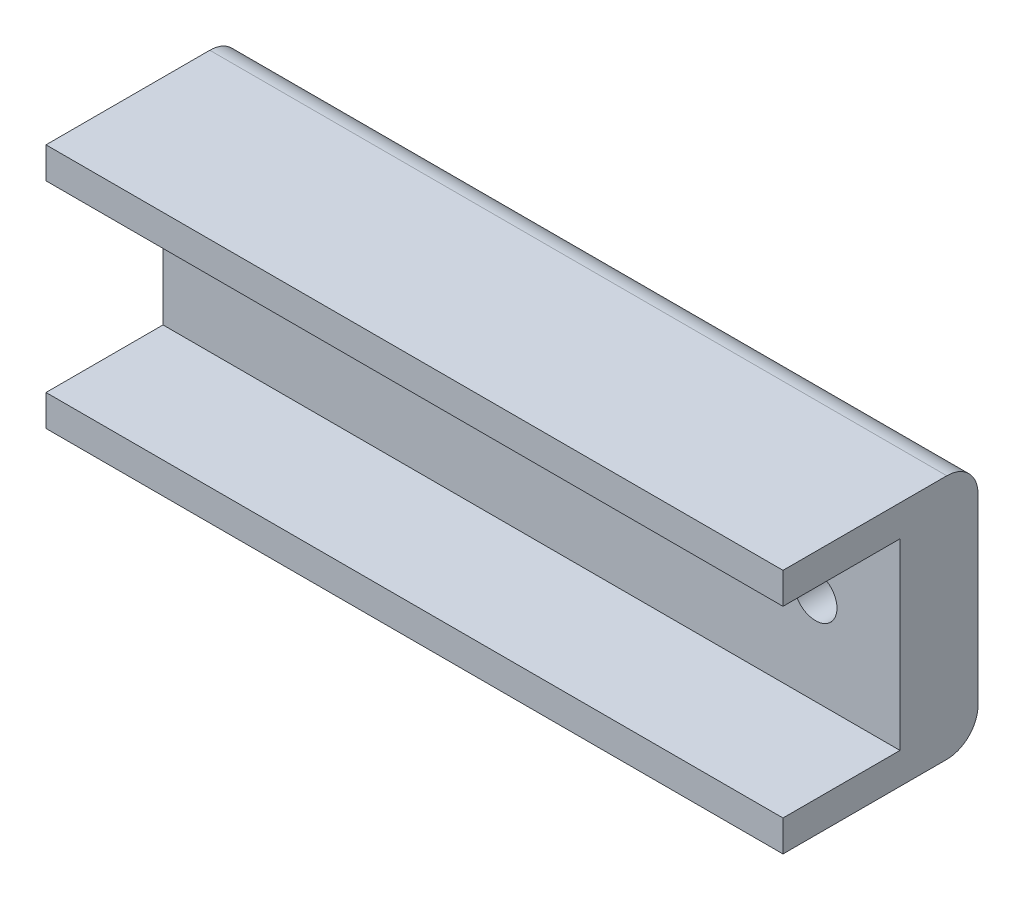
ISO-10303-21;
HEADER;
FILE_DESCRIPTION(('STEP AP214'),'2;1');
FILE_NAME('part.step','',(''),(''),'','','');
FILE_SCHEMA(('AUTOMOTIVE_DESIGN { 1 0 10303 214 1 1 1 1 }'));
ENDSEC;
DATA;
#1=APPLICATION_CONTEXT('core data for automotive mechanical design processes');
#2=APPLICATION_PROTOCOL_DEFINITION('international standard','automotive_design',2000,#1);
#3=PRODUCT_CONTEXT('',#1,'mechanical');
#4=PRODUCT('Part','Part','',(#3));
#5=PRODUCT_RELATED_PRODUCT_CATEGORY('part','',(#4));
#6=PRODUCT_DEFINITION_FORMATION('','',#4);
#7=PRODUCT_DEFINITION_CONTEXT('part definition',#1,'design');
#8=PRODUCT_DEFINITION('design','',#6,#7);
#9=PRODUCT_DEFINITION_SHAPE('','',#8);
#10=(LENGTH_UNIT() NAMED_UNIT(*) SI_UNIT(.MILLI.,.METRE.));
#11=(NAMED_UNIT(*) PLANE_ANGLE_UNIT() SI_UNIT($,.RADIAN.));
#12=(NAMED_UNIT(*) SI_UNIT($,.STERADIAN.) SOLID_ANGLE_UNIT());
#13=UNCERTAINTY_MEASURE_WITH_UNIT(LENGTH_MEASURE(1.E-05),#10,'distance_accuracy_value','');
#14=(GEOMETRIC_REPRESENTATION_CONTEXT(3) GLOBAL_UNCERTAINTY_ASSIGNED_CONTEXT((#13)) GLOBAL_UNIT_ASSIGNED_CONTEXT((#10,
#11,#12)) REPRESENTATION_CONTEXT('',''));
#15=CARTESIAN_POINT('',(0.,0.,0.));
#16=DIRECTION('',(0.,0.,1.));
#17=DIRECTION('',(1.,0.,0.));
#18=AXIS2_PLACEMENT_3D('',#15,#16,#17);
#19=CARTESIAN_POINT('',(0.,0.,6.35));
#20=DIRECTION('',(0.,0.,1.));
#21=DIRECTION('',(1.,0.,0.));
#22=AXIS2_PLACEMENT_3D('',#19,#20,#21);
#23=PLANE('',#22);
#24=CARTESIAN_POINT('',(-23.12,0.,6.35));
#25=DIRECTION('',(0.,0.,1.));
#26=DIRECTION('',(1.,0.,0.));
#27=AXIS2_PLACEMENT_3D('',#24,#25,#26);
#28=CIRCLE('',#27,1.75);
#29=CARTESIAN_POINT('',(-21.37,0.,6.35));
#30=VERTEX_POINT('',#29);
#31=EDGE_CURVE('E200',#30,#30,#28,.T.);
#32=ORIENTED_EDGE('',*,*,#31,.F.);
#33=EDGE_LOOP('',(#32));
#34=FACE_BOUND('',#33,.T.);
#35=CARTESIAN_POINT('',(23.12,0.,6.35));
#36=DIRECTION('',(0.,0.,1.));
#37=DIRECTION('',(1.,0.,0.));
#38=AXIS2_PLACEMENT_3D('',#35,#36,#37);
#39=CIRCLE('',#38,1.75);
#40=CARTESIAN_POINT('',(24.87,0.,6.35));
#41=VERTEX_POINT('',#40);
#42=EDGE_CURVE('E192',#41,#41,#39,.T.);
#43=ORIENTED_EDGE('',*,*,#42,.F.);
#44=EDGE_LOOP('',(#43));
#45=FACE_BOUND('',#44,.T.);
#46=DIRECTION('',(0.,-1.,0.));
#47=VECTOR('',#46,1.);
#48=CARTESIAN_POINT('',(-30.,-10.,6.35));
#49=LINE('',#48,#47);
#50=CARTESIAN_POINT('',(-30.,7.46,6.35));
#51=VERTEX_POINT('',#50);
#52=CARTESIAN_POINT('',(-30.,-7.46,6.35));
#53=VERTEX_POINT('',#52);
#54=EDGE_CURVE('E208',#51,#53,#49,.T.);
#55=ORIENTED_EDGE('',*,*,#54,.T.);
#56=DIRECTION('',(-1.,0.,0.));
#57=VECTOR('',#56,1.);
#58=CARTESIAN_POINT('',(-30.,-7.46,6.35));
#59=LINE('',#58,#57);
#60=CARTESIAN_POINT('',(30.,-7.46,6.35));
#61=VERTEX_POINT('',#60);
#62=EDGE_CURVE('E147',#61,#53,#59,.T.);
#63=ORIENTED_EDGE('',*,*,#62,.F.);
#64=DIRECTION('',(0.,1.,0.));
#65=VECTOR('',#64,1.);
#66=CARTESIAN_POINT('',(30.,-9.99999999999999,6.35));
#67=LINE('',#66,#65);
#68=CARTESIAN_POINT('',(30.,7.46,6.35));
#69=VERTEX_POINT('',#68);
#70=EDGE_CURVE('E211',#61,#69,#67,.T.);
#71=ORIENTED_EDGE('',*,*,#70,.T.);
#72=DIRECTION('',(1.,0.,0.));
#73=VECTOR('',#72,1.);
#74=CARTESIAN_POINT('',(-30.,7.46,6.35));
#75=LINE('',#74,#73);
#76=EDGE_CURVE('E164',#51,#69,#75,.T.);
#77=ORIENTED_EDGE('',*,*,#76,.F.);
#78=EDGE_LOOP('',(#55,#63,#71,#77));
#79=FACE_BOUND('',#78,.T.);
#80=ADVANCED_FACE('F38',(#34,#45,#79),#23,.T.);
#81=CARTESIAN_POINT('',(0.,0.,0.));
#82=DIRECTION('',(0.,0.,1.));
#83=DIRECTION('',(1.,0.,0.));
#84=AXIS2_PLACEMENT_3D('',#81,#82,#83);
#85=PLANE('',#84);
#86=DIRECTION('',(0.,-1.,0.));
#87=VECTOR('',#86,1.);
#88=CARTESIAN_POINT('',(-30.,-10.,0.));
#89=LINE('',#88,#87);
#90=CARTESIAN_POINT('',(-30.,7.46,0.));
#91=VERTEX_POINT('',#90);
#92=CARTESIAN_POINT('',(-30.,-7.46,0.));
#93=VERTEX_POINT('',#92);
#94=EDGE_CURVE('E204',#91,#93,#89,.T.);
#95=ORIENTED_EDGE('',*,*,#94,.F.);
#96=DIRECTION('',(-1.,0.,0.));
#97=VECTOR('',#96,1.);
#98=CARTESIAN_POINT('',(0.,7.46,0.));
#99=LINE('',#98,#97);
#100=CARTESIAN_POINT('',(30.,7.45999999999999,0.));
#101=VERTEX_POINT('',#100);
#102=EDGE_CURVE('E61',#91,#101,#99,.F.);
#103=ORIENTED_EDGE('',*,*,#102,.T.);
#104=DIRECTION('',(0.,1.,0.));
#105=VECTOR('',#104,1.);
#106=CARTESIAN_POINT('',(30.,-9.99999999999999,0.));
#107=LINE('',#106,#105);
#108=CARTESIAN_POINT('',(30.,-7.45999999999999,0.));
#109=VERTEX_POINT('',#108);
#110=EDGE_CURVE('E212',#109,#101,#107,.T.);
#111=ORIENTED_EDGE('',*,*,#110,.F.);
#112=DIRECTION('',(1.,0.,0.));
#113=VECTOR('',#112,1.);
#114=CARTESIAN_POINT('',(0.,-7.46,0.));
#115=LINE('',#114,#113);
#116=EDGE_CURVE('E236',#109,#93,#115,.F.);
#117=ORIENTED_EDGE('',*,*,#116,.T.);
#118=EDGE_LOOP('',(#95,#103,#111,#117));
#119=FACE_BOUND('',#118,.T.);
#120=CARTESIAN_POINT('',(-23.12,0.,0.));
#121=DIRECTION('',(0.,0.,1.));
#122=DIRECTION('',(1.,0.,0.));
#123=AXIS2_PLACEMENT_3D('',#120,#121,#122);
#124=CIRCLE('',#123,1.75);
#125=CARTESIAN_POINT('',(-21.37,0.,0.));
#126=VERTEX_POINT('',#125);
#127=EDGE_CURVE('E196',#126,#126,#124,.T.);
#128=ORIENTED_EDGE('',*,*,#127,.T.);
#129=EDGE_LOOP('',(#128));
#130=FACE_BOUND('',#129,.T.);
#131=CARTESIAN_POINT('',(23.12,0.,0.));
#132=DIRECTION('',(0.,0.,1.));
#133=DIRECTION('',(1.,0.,0.));
#134=AXIS2_PLACEMENT_3D('',#131,#132,#133);
#135=CIRCLE('',#134,1.75);
#136=CARTESIAN_POINT('',(24.87,0.,0.));
#137=VERTEX_POINT('',#136);
#138=EDGE_CURVE('E191',#137,#137,#135,.T.);
#139=ORIENTED_EDGE('',*,*,#138,.T.);
#140=EDGE_LOOP('',(#139));
#141=FACE_BOUND('',#140,.T.);
#142=ADVANCED_FACE('F254',(#119,#130,#141),#85,.F.);
#143=CARTESIAN_POINT('',(-30.,-10.,6.35));
#144=DIRECTION('',(1.,0.,0.));
#145=DIRECTION('',(0.,0.,-1.));
#146=AXIS2_PLACEMENT_3D('',#143,#144,#145);
#147=PLANE('',#146);
#148=DIRECTION('',(0.,0.,-1.));
#149=VECTOR('',#148,1.);
#150=CARTESIAN_POINT('',(-30.,10.,6.35));
#151=LINE('',#150,#149);
#152=CARTESIAN_POINT('',(-30.,10.,15.875));
#153=VERTEX_POINT('',#152);
#154=CARTESIAN_POINT('',(-30.,10.,2.54));
#155=VERTEX_POINT('',#154);
#156=EDGE_CURVE('E215',#153,#155,#151,.T.);
#157=ORIENTED_EDGE('',*,*,#156,.T.);
#158=CARTESIAN_POINT('',(-30.,7.46,2.54));
#159=DIRECTION('',(1.,0.,0.));
#160=DIRECTION('',(0.,0.,-1.));
#161=AXIS2_PLACEMENT_3D('',#158,#159,#160);
#162=CIRCLE('',#161,2.54);
#163=EDGE_CURVE('E233',#155,#91,#162,.F.);
#164=ORIENTED_EDGE('',*,*,#163,.T.);
#165=ORIENTED_EDGE('',*,*,#94,.T.);
#166=CARTESIAN_POINT('',(-30.,-7.46,2.54));
#167=DIRECTION('',(1.,0.,0.));
#168=DIRECTION('',(0.,0.,-1.));
#169=AXIS2_PLACEMENT_3D('',#166,#167,#168);
#170=CIRCLE('',#169,2.54);
#171=CARTESIAN_POINT('',(-30.,-10.,2.54));
#172=VERTEX_POINT('',#171);
#173=EDGE_CURVE('E127',#93,#172,#170,.F.);
#174=ORIENTED_EDGE('',*,*,#173,.T.);
#175=DIRECTION('',(0.,0.,-1.));
#176=VECTOR('',#175,1.);
#177=CARTESIAN_POINT('',(-30.,-10.,6.35));
#178=LINE('',#177,#176);
#179=CARTESIAN_POINT('',(-30.,-10.,15.875));
#180=VERTEX_POINT('',#179);
#181=EDGE_CURVE('E118',#180,#172,#178,.T.);
#182=ORIENTED_EDGE('',*,*,#181,.F.);
#183=DIRECTION('',(0.,-1.,0.));
#184=VECTOR('',#183,1.);
#185=CARTESIAN_POINT('',(-30.,-10.,15.875));
#186=LINE('',#185,#184);
#187=CARTESIAN_POINT('',(-30.,-7.46,15.875));
#188=VERTEX_POINT('',#187);
#189=EDGE_CURVE('E124',#188,#180,#186,.T.);
#190=ORIENTED_EDGE('',*,*,#189,.F.);
#191=DIRECTION('',(0.,0.,-1.));
#192=VECTOR('',#191,1.);
#193=CARTESIAN_POINT('',(-30.,-7.46,15.875));
#194=LINE('',#193,#192);
#195=EDGE_CURVE('E156',#188,#53,#194,.T.);
#196=ORIENTED_EDGE('',*,*,#195,.T.);
#197=ORIENTED_EDGE('',*,*,#54,.F.);
#198=DIRECTION('',(0.,0.,-1.));
#199=VECTOR('',#198,1.);
#200=CARTESIAN_POINT('',(-30.,7.46,15.875));
#201=LINE('',#200,#199);
#202=CARTESIAN_POINT('',(-30.,7.46,15.875));
#203=VERTEX_POINT('',#202);
#204=EDGE_CURVE('E187',#203,#51,#201,.T.);
#205=ORIENTED_EDGE('',*,*,#204,.F.);
#206=DIRECTION('',(0.,-1.,0.));
#207=VECTOR('',#206,1.);
#208=CARTESIAN_POINT('',(-30.,10.,15.875));
#209=LINE('',#208,#207);
#210=EDGE_CURVE('E165',#153,#203,#209,.T.);
#211=ORIENTED_EDGE('',*,*,#210,.F.);
#212=EDGE_LOOP('',(#157,#164,#165,#174,#182,#190,#196,#197,#205,#211));
#213=FACE_BOUND('',#212,.T.);
#214=ADVANCED_FACE('F121',(#213),#147,.F.);
#215=CARTESIAN_POINT('',(30.,-9.99999999999999,6.35));
#216=DIRECTION('',(0.,1.,0.));
#217=DIRECTION('',(-1.,0.,0.));
#218=AXIS2_PLACEMENT_3D('',#215,#216,#217);
#219=PLANE('',#218);
#220=ORIENTED_EDGE('',*,*,#181,.T.);
#221=DIRECTION('',(1.,0.,0.));
#222=VECTOR('',#221,1.);
#223=CARTESIAN_POINT('',(30.,-9.99999999999999,2.54));
#224=LINE('',#223,#222);
#225=CARTESIAN_POINT('',(30.,-9.99999999999999,2.54));
#226=VERTEX_POINT('',#225);
#227=EDGE_CURVE('E11',#172,#226,#224,.T.);
#228=ORIENTED_EDGE('',*,*,#227,.T.);
#229=DIRECTION('',(0.,0.,-1.));
#230=VECTOR('',#229,1.);
#231=CARTESIAN_POINT('',(30.,-9.99999999999999,6.35));
#232=LINE('',#231,#230);
#233=CARTESIAN_POINT('',(30.,-10.,15.875));
#234=VERTEX_POINT('',#233);
#235=EDGE_CURVE('E131',#234,#226,#232,.T.);
#236=ORIENTED_EDGE('',*,*,#235,.F.);
#237=DIRECTION('',(1.,0.,0.));
#238=VECTOR('',#237,1.);
#239=CARTESIAN_POINT('',(-30.,-10.,15.875));
#240=LINE('',#239,#238);
#241=EDGE_CURVE('E134',#180,#234,#240,.T.);
#242=ORIENTED_EDGE('',*,*,#241,.F.);
#243=EDGE_LOOP('',(#220,#228,#236,#242));
#244=FACE_BOUND('',#243,.T.);
#245=ADVANCED_FACE('F135',(#244),#219,.F.);
#246=CARTESIAN_POINT('',(30.,-9.99999999999999,6.35));
#247=DIRECTION('',(-1.,0.,0.));
#248=DIRECTION('',(0.,0.,1.));
#249=AXIS2_PLACEMENT_3D('',#246,#247,#248);
#250=PLANE('',#249);
#251=ORIENTED_EDGE('',*,*,#110,.T.);
#252=CARTESIAN_POINT('',(30.,7.45999999999999,2.54));
#253=DIRECTION('',(-1.,0.,0.));
#254=DIRECTION('',(0.,0.,1.));
#255=AXIS2_PLACEMENT_3D('',#252,#253,#254);
#256=CIRCLE('',#255,2.54);
#257=CARTESIAN_POINT('',(30.,9.99999999999999,2.54));
#258=VERTEX_POINT('',#257);
#259=EDGE_CURVE('E47',#101,#258,#256,.F.);
#260=ORIENTED_EDGE('',*,*,#259,.T.);
#261=DIRECTION('',(0.,0.,-1.));
#262=VECTOR('',#261,1.);
#263=CARTESIAN_POINT('',(30.,9.99999999999999,6.35));
#264=LINE('',#263,#262);
#265=CARTESIAN_POINT('',(30.,10.,15.875));
#266=VERTEX_POINT('',#265);
#267=EDGE_CURVE('E222',#266,#258,#264,.T.);
#268=ORIENTED_EDGE('',*,*,#267,.F.);
#269=DIRECTION('',(0.,1.,0.));
#270=VECTOR('',#269,1.);
#271=CARTESIAN_POINT('',(30.,10.,15.875));
#272=LINE('',#271,#270);
#273=CARTESIAN_POINT('',(30.,7.46,15.875));
#274=VERTEX_POINT('',#273);
#275=EDGE_CURVE('E172',#274,#266,#272,.T.);
#276=ORIENTED_EDGE('',*,*,#275,.F.);
#277=DIRECTION('',(0.,0.,-1.));
#278=VECTOR('',#277,1.);
#279=CARTESIAN_POINT('',(30.,7.46,15.875));
#280=LINE('',#279,#278);
#281=EDGE_CURVE('E180',#274,#69,#280,.T.);
#282=ORIENTED_EDGE('',*,*,#281,.T.);
#283=ORIENTED_EDGE('',*,*,#70,.F.);
#284=DIRECTION('',(0.,0.,-1.));
#285=VECTOR('',#284,1.);
#286=CARTESIAN_POINT('',(30.,-7.46,15.875));
#287=LINE('',#286,#285);
#288=CARTESIAN_POINT('',(30.,-7.46,15.875));
#289=VERTEX_POINT('',#288);
#290=EDGE_CURVE('E160',#289,#61,#287,.T.);
#291=ORIENTED_EDGE('',*,*,#290,.F.);
#292=DIRECTION('',(0.,1.,0.));
#293=VECTOR('',#292,1.);
#294=CARTESIAN_POINT('',(30.,-10.,15.875));
#295=LINE('',#294,#293);
#296=EDGE_CURVE('E140',#234,#289,#295,.T.);
#297=ORIENTED_EDGE('',*,*,#296,.F.);
#298=ORIENTED_EDGE('',*,*,#235,.T.);
#299=CARTESIAN_POINT('',(30.,-7.45999999999999,2.54));
#300=DIRECTION('',(-1.,0.,0.));
#301=DIRECTION('',(0.,0.,1.));
#302=AXIS2_PLACEMENT_3D('',#299,#300,#301);
#303=CIRCLE('',#302,2.54);
#304=EDGE_CURVE('E54',#226,#109,#303,.F.);
#305=ORIENTED_EDGE('',*,*,#304,.T.);
#306=EDGE_LOOP('',(#251,#260,#268,#276,#282,#283,#291,#297,#298,#305));
#307=FACE_BOUND('',#306,.T.);
#308=ADVANCED_FACE('F245',(#307),#250,.F.);
#309=CARTESIAN_POINT('',(30.,9.99999999999999,6.35));
#310=DIRECTION('',(0.,-1.,0.));
#311=DIRECTION('',(1.,0.,0.));
#312=AXIS2_PLACEMENT_3D('',#309,#310,#311);
#313=PLANE('',#312);
#314=ORIENTED_EDGE('',*,*,#267,.T.);
#315=DIRECTION('',(-1.,0.,0.));
#316=VECTOR('',#315,1.);
#317=CARTESIAN_POINT('',(30.,9.99999999999999,2.54));
#318=LINE('',#317,#316);
#319=EDGE_CURVE('E130',#258,#155,#318,.T.);
#320=ORIENTED_EDGE('',*,*,#319,.T.);
#321=ORIENTED_EDGE('',*,*,#156,.F.);
#322=DIRECTION('',(-1.,0.,0.));
#323=VECTOR('',#322,1.);
#324=CARTESIAN_POINT('',(-30.,10.,15.875));
#325=LINE('',#324,#323);
#326=EDGE_CURVE('E176',#266,#153,#325,.T.);
#327=ORIENTED_EDGE('',*,*,#326,.F.);
#328=EDGE_LOOP('',(#314,#320,#321,#327));
#329=FACE_BOUND('',#328,.T.);
#330=ADVANCED_FACE('F251',(#329),#313,.F.);
#331=CARTESIAN_POINT('',(-23.12,0.,6.35));
#332=DIRECTION('',(0.,0.,-1.));
#333=DIRECTION('',(-1.,0.,0.));
#334=AXIS2_PLACEMENT_3D('',#331,#332,#333);
#335=CYLINDRICAL_SURFACE('',#334,1.75);
#336=ORIENTED_EDGE('',*,*,#31,.T.);
#337=EDGE_LOOP('',(#336));
#338=FACE_BOUND('',#337,.T.);
#339=ORIENTED_EDGE('',*,*,#127,.F.);
#340=EDGE_LOOP('',(#339));
#341=FACE_BOUND('',#340,.T.);
#342=ADVANCED_FACE('F289',(#338,#341),#335,.F.);
#343=CARTESIAN_POINT('',(23.12,0.,6.35));
#344=DIRECTION('',(0.,0.,-1.));
#345=DIRECTION('',(-1.,0.,0.));
#346=AXIS2_PLACEMENT_3D('',#343,#344,#345);
#347=CYLINDRICAL_SURFACE('',#346,1.75);
#348=ORIENTED_EDGE('',*,*,#42,.T.);
#349=EDGE_LOOP('',(#348));
#350=FACE_BOUND('',#349,.T.);
#351=ORIENTED_EDGE('',*,*,#138,.F.);
#352=EDGE_LOOP('',(#351));
#353=FACE_BOUND('',#352,.T.);
#354=ADVANCED_FACE('F275',(#350,#353),#347,.F.);
#355=CARTESIAN_POINT('',(-30.,7.46,15.875));
#356=DIRECTION('',(0.,1.,0.));
#357=DIRECTION('',(0.,0.,1.));
#358=AXIS2_PLACEMENT_3D('',#355,#356,#357);
#359=PLANE('',#358);
#360=ORIENTED_EDGE('',*,*,#76,.T.);
#361=ORIENTED_EDGE('',*,*,#281,.F.);
#362=DIRECTION('',(1.,0.,0.));
#363=VECTOR('',#362,1.);
#364=CARTESIAN_POINT('',(-30.,7.46,15.875));
#365=LINE('',#364,#363);
#366=EDGE_CURVE('E169',#203,#274,#365,.T.);
#367=ORIENTED_EDGE('',*,*,#366,.F.);
#368=ORIENTED_EDGE('',*,*,#204,.T.);
#369=EDGE_LOOP('',(#360,#361,#367,#368));
#370=FACE_BOUND('',#369,.T.);
#371=ADVANCED_FACE('F264',(#370),#359,.F.);
#372=CARTESIAN_POINT('',(0.,0.,15.875));
#373=DIRECTION('',(0.,0.,1.));
#374=DIRECTION('',(1.,0.,0.));
#375=AXIS2_PLACEMENT_3D('',#372,#373,#374);
#376=PLANE('',#375);
#377=ORIENTED_EDGE('',*,*,#210,.T.);
#378=ORIENTED_EDGE('',*,*,#366,.T.);
#379=ORIENTED_EDGE('',*,*,#275,.T.);
#380=ORIENTED_EDGE('',*,*,#326,.T.);
#381=EDGE_LOOP('',(#377,#378,#379,#380));
#382=FACE_BOUND('',#381,.T.);
#383=ADVANCED_FACE('F267',(#382),#376,.T.);
#384=CARTESIAN_POINT('',(-30.,-7.46,15.875));
#385=DIRECTION('',(0.,-1.,0.));
#386=DIRECTION('',(0.,0.,-1.));
#387=AXIS2_PLACEMENT_3D('',#384,#385,#386);
#388=PLANE('',#387);
#389=ORIENTED_EDGE('',*,*,#62,.T.);
#390=ORIENTED_EDGE('',*,*,#195,.F.);
#391=DIRECTION('',(-1.,0.,0.));
#392=VECTOR('',#391,1.);
#393=CARTESIAN_POINT('',(-30.,-7.46,15.875));
#394=LINE('',#393,#392);
#395=EDGE_CURVE('E144',#289,#188,#394,.T.);
#396=ORIENTED_EDGE('',*,*,#395,.F.);
#397=ORIENTED_EDGE('',*,*,#290,.T.);
#398=EDGE_LOOP('',(#389,#390,#396,#397));
#399=FACE_BOUND('',#398,.T.);
#400=ADVANCED_FACE('F259',(#399),#388,.F.);
#401=CARTESIAN_POINT('',(0.,0.,15.875));
#402=DIRECTION('',(0.,0.,-1.));
#403=DIRECTION('',(-1.,0.,0.));
#404=AXIS2_PLACEMENT_3D('',#401,#402,#403);
#405=PLANE('',#404);
#406=ORIENTED_EDGE('',*,*,#189,.T.);
#407=ORIENTED_EDGE('',*,*,#241,.T.);
#408=ORIENTED_EDGE('',*,*,#296,.T.);
#409=ORIENTED_EDGE('',*,*,#395,.T.);
#410=EDGE_LOOP('',(#406,#407,#408,#409));
#411=FACE_BOUND('',#410,.T.);
#412=ADVANCED_FACE('F142',(#411),#405,.F.);
#413=CARTESIAN_POINT('',(30.,7.45999999999999,2.54));
#414=DIRECTION('',(-1.,0.,0.));
#415=DIRECTION('',(0.,-1.,0.));
#416=AXIS2_PLACEMENT_3D('',#413,#414,#415);
#417=CYLINDRICAL_SURFACE('',#416,2.54);
#418=ORIENTED_EDGE('',*,*,#259,.F.);
#419=ORIENTED_EDGE('',*,*,#102,.F.);
#420=ORIENTED_EDGE('',*,*,#163,.F.);
#421=ORIENTED_EDGE('',*,*,#319,.F.);
#422=EDGE_LOOP('',(#418,#419,#420,#421));
#423=FACE_BOUND('',#422,.T.);
#424=ADVANCED_FACE('F252',(#423),#417,.T.);
#425=CARTESIAN_POINT('',(30.,-7.45999999999999,2.54));
#426=DIRECTION('',(1.,0.,0.));
#427=DIRECTION('',(0.,1.,0.));
#428=AXIS2_PLACEMENT_3D('',#425,#426,#427);
#429=CYLINDRICAL_SURFACE('',#428,2.54);
#430=ORIENTED_EDGE('',*,*,#173,.F.);
#431=ORIENTED_EDGE('',*,*,#116,.F.);
#432=ORIENTED_EDGE('',*,*,#304,.F.);
#433=ORIENTED_EDGE('',*,*,#227,.F.);
#434=EDGE_LOOP('',(#430,#431,#432,#433));
#435=FACE_BOUND('',#434,.T.);
#436=ADVANCED_FACE('F40',(#435),#429,.T.);
#437=CLOSED_SHELL('',(#80,#142,#214,#245,#308,#330,#342,#354,#371,#383,#400,#412,#424,#436));
#438=MANIFOLD_SOLID_BREP('B2',#437);
#439=ADVANCED_BREP_SHAPE_REPRESENTATION('',(#18,#438),#14);
#440=SHAPE_DEFINITION_REPRESENTATION(#9,#439);
ENDSEC;
END-ISO-10303-21;
